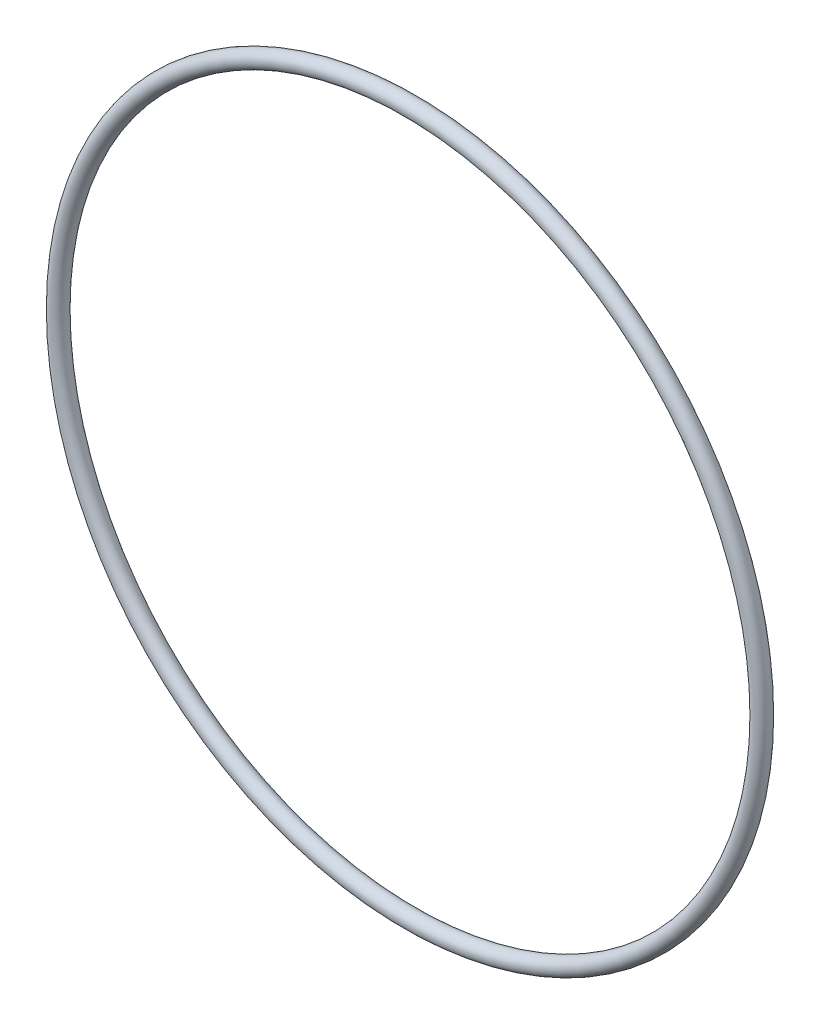
ISO-10303-21;
HEADER;
FILE_DESCRIPTION(('STEP AP214'),'2;1');
FILE_NAME('part.step','',(''),(''),'','','');
FILE_SCHEMA(('AUTOMOTIVE_DESIGN { 1 0 10303 214 1 1 1 1 }'));
ENDSEC;
DATA;
#1=APPLICATION_CONTEXT('core data for automotive mechanical design processes');
#2=APPLICATION_PROTOCOL_DEFINITION('international standard','automotive_design',2000,#1);
#3=PRODUCT_CONTEXT('',#1,'mechanical');
#4=PRODUCT('Part','Part','',(#3));
#5=PRODUCT_RELATED_PRODUCT_CATEGORY('part','',(#4));
#6=PRODUCT_DEFINITION_FORMATION('','',#4);
#7=PRODUCT_DEFINITION_CONTEXT('part definition',#1,'design');
#8=PRODUCT_DEFINITION('design','',#6,#7);
#9=PRODUCT_DEFINITION_SHAPE('','',#8);
#10=(LENGTH_UNIT() NAMED_UNIT(*) SI_UNIT(.MILLI.,.METRE.));
#11=(NAMED_UNIT(*) PLANE_ANGLE_UNIT() SI_UNIT($,.RADIAN.));
#12=(NAMED_UNIT(*) SI_UNIT($,.STERADIAN.) SOLID_ANGLE_UNIT());
#13=UNCERTAINTY_MEASURE_WITH_UNIT(LENGTH_MEASURE(1.E-05),#10,'distance_accuracy_value','');
#14=(GEOMETRIC_REPRESENTATION_CONTEXT(3) GLOBAL_UNCERTAINTY_ASSIGNED_CONTEXT((#13)) GLOBAL_UNIT_ASSIGNED_CONTEXT((#10,
#11,#12)) REPRESENTATION_CONTEXT('',''));
#15=CARTESIAN_POINT('',(0.,0.,0.));
#16=DIRECTION('',(0.,0.,1.));
#17=DIRECTION('',(1.,0.,0.));
#18=AXIS2_PLACEMENT_3D('',#15,#16,#17);
#19=CARTESIAN_POINT('',(0.,0.,0.));
#20=DIRECTION('',(0.,0.,1.));
#21=DIRECTION('',(1.,0.,0.));
#22=AXIS2_PLACEMENT_3D('',#19,#20,#21);
#23=TOROIDAL_SURFACE('',#22,37.2618,0.889000000000003);
#24=CARTESIAN_POINT('',(38.1508,0.,0.));
#25=VERTEX_POINT('',#24);
#26=VERTEX_LOOP('',#25);
#27=FACE_BOUND('',#26,.T.);
#28=ADVANCED_FACE('F32',(#27),#23,.T.);
#29=CLOSED_SHELL('',(#28));
#30=MANIFOLD_SOLID_BREP('B2',#29);
#31=ADVANCED_BREP_SHAPE_REPRESENTATION('',(#18,#30),#14);
#32=SHAPE_DEFINITION_REPRESENTATION(#9,#31);
ENDSEC;
END-ISO-10303-21;
